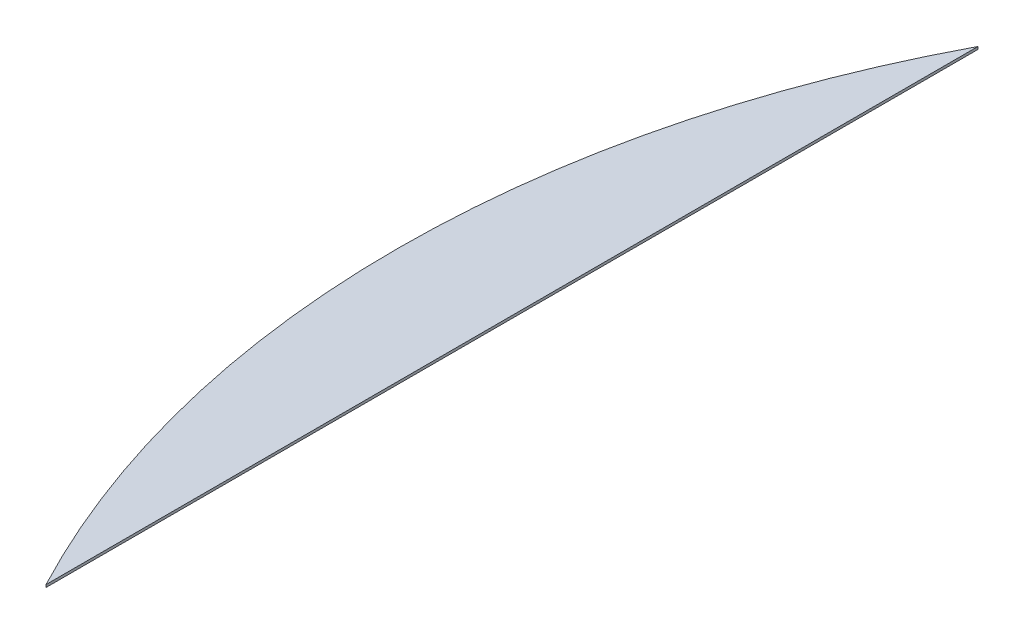
ISO-10303-21;
HEADER;
FILE_DESCRIPTION(('STEP AP214'),'2;1');
FILE_NAME('part.step','',(''),(''),'','','');
FILE_SCHEMA(('AUTOMOTIVE_DESIGN { 1 0 10303 214 1 1 1 1 }'));
ENDSEC;
DATA;
#1=APPLICATION_CONTEXT('core data for automotive mechanical design processes');
#2=APPLICATION_PROTOCOL_DEFINITION('international standard','automotive_design',2000,#1);
#3=PRODUCT_CONTEXT('',#1,'mechanical');
#4=PRODUCT('Part','Part','',(#3));
#5=PRODUCT_RELATED_PRODUCT_CATEGORY('part','',(#4));
#6=PRODUCT_DEFINITION_FORMATION('','',#4);
#7=PRODUCT_DEFINITION_CONTEXT('part definition',#1,'design');
#8=PRODUCT_DEFINITION('design','',#6,#7);
#9=PRODUCT_DEFINITION_SHAPE('','',#8);
#10=(LENGTH_UNIT() NAMED_UNIT(*) SI_UNIT(.MILLI.,.METRE.));
#11=(NAMED_UNIT(*) PLANE_ANGLE_UNIT() SI_UNIT($,.RADIAN.));
#12=(NAMED_UNIT(*) SI_UNIT($,.STERADIAN.) SOLID_ANGLE_UNIT());
#13=UNCERTAINTY_MEASURE_WITH_UNIT(LENGTH_MEASURE(1.E-05),#10,'distance_accuracy_value','');
#14=(GEOMETRIC_REPRESENTATION_CONTEXT(3) GLOBAL_UNCERTAINTY_ASSIGNED_CONTEXT((#13)) GLOBAL_UNIT_ASSIGNED_CONTEXT((#10,
#11,#12)) REPRESENTATION_CONTEXT('',''));
#15=CARTESIAN_POINT('',(0.,0.,0.));
#16=DIRECTION('',(0.,0.,1.));
#17=DIRECTION('',(1.,0.,0.));
#18=AXIS2_PLACEMENT_3D('',#15,#16,#17);
#19=CARTESIAN_POINT('',(0.,1043.,0.));
#20=DIRECTION('',(0.,-1.,0.));
#21=DIRECTION('',(0.,0.,-1.));
#22=AXIS2_PLACEMENT_3D('',#19,#20,#21);
#23=CYLINDRICAL_SURFACE('',#22,772.);
#24=CARTESIAN_POINT('',(0.,1041.,0.));
#25=DIRECTION('',(0.,1.,0.));
#26=DIRECTION('',(0.,0.,1.));
#27=AXIS2_PLACEMENT_3D('',#24,#25,#26);
#28=CIRCLE('',#27,772.);
#29=CARTESIAN_POINT('',(-683.,1041.,-359.854137116693));
#30=VERTEX_POINT('',#29);
#31=CARTESIAN_POINT('',(-683.,1041.,359.854137116693));
#32=VERTEX_POINT('',#31);
#33=EDGE_CURVE('E73',#30,#32,#28,.T.);
#34=ORIENTED_EDGE('',*,*,#33,.T.);
#35=DIRECTION('',(0.,-1.,0.));
#36=VECTOR('',#35,1.);
#37=CARTESIAN_POINT('',(-683.,1043.,359.854137116693));
#38=LINE('',#37,#36);
#39=CARTESIAN_POINT('',(-683.,1043.,359.854137116693));
#40=VERTEX_POINT('',#39);
#41=EDGE_CURVE('E11',#40,#32,#38,.T.);
#42=ORIENTED_EDGE('',*,*,#41,.F.);
#43=CARTESIAN_POINT('',(0.,1043.,0.));
#44=DIRECTION('',(0.,1.,0.));
#45=DIRECTION('',(0.,0.,1.));
#46=AXIS2_PLACEMENT_3D('',#43,#44,#45);
#47=CIRCLE('',#46,772.);
#48=CARTESIAN_POINT('',(-683.,1043.,-359.854137116693));
#49=VERTEX_POINT('',#48);
#50=EDGE_CURVE('E72',#49,#40,#47,.T.);
#51=ORIENTED_EDGE('',*,*,#50,.F.);
#52=DIRECTION('',(0.,-1.,0.));
#53=VECTOR('',#52,1.);
#54=CARTESIAN_POINT('',(-683.,1043.,-359.854137116693));
#55=LINE('',#54,#53);
#56=EDGE_CURVE('E49',#49,#30,#55,.T.);
#57=ORIENTED_EDGE('',*,*,#56,.T.);
#58=EDGE_LOOP('',(#34,#42,#51,#57));
#59=FACE_BOUND('',#58,.T.);
#60=ADVANCED_FACE('F40',(#59),#23,.T.);
#61=CARTESIAN_POINT('',(-683.,1043.,-359.854137116693));
#62=DIRECTION('',(-1.,0.,0.));
#63=DIRECTION('',(0.,0.,1.));
#64=AXIS2_PLACEMENT_3D('',#61,#62,#63);
#65=PLANE('',#64);
#66=DIRECTION('',(0.,0.,-1.));
#67=VECTOR('',#66,1.);
#68=CARTESIAN_POINT('',(-683.,1041.,-359.854137116693));
#69=LINE('',#68,#67);
#70=EDGE_CURVE('E64',#32,#30,#69,.T.);
#71=ORIENTED_EDGE('',*,*,#70,.T.);
#72=ORIENTED_EDGE('',*,*,#56,.F.);
#73=DIRECTION('',(0.,0.,-1.));
#74=VECTOR('',#73,1.);
#75=CARTESIAN_POINT('',(-683.,1043.,-359.854137116693));
#76=LINE('',#75,#74);
#77=EDGE_CURVE('E56',#40,#49,#76,.T.);
#78=ORIENTED_EDGE('',*,*,#77,.F.);
#79=ORIENTED_EDGE('',*,*,#41,.T.);
#80=EDGE_LOOP('',(#71,#72,#78,#79));
#81=FACE_BOUND('',#80,.T.);
#82=ADVANCED_FACE('F67',(#81),#65,.F.);
#83=CARTESIAN_POINT('',(0.,1043.,0.));
#84=DIRECTION('',(0.,1.,0.));
#85=DIRECTION('',(0.,0.,1.));
#86=AXIS2_PLACEMENT_3D('',#83,#84,#85);
#87=PLANE('',#86);
#88=ORIENTED_EDGE('',*,*,#50,.T.);
#89=ORIENTED_EDGE('',*,*,#77,.T.);
#90=EDGE_LOOP('',(#88,#89));
#91=FACE_BOUND('',#90,.T.);
#92=ADVANCED_FACE('F86',(#91),#87,.T.);
#93=CARTESIAN_POINT('',(0.,1041.,0.));
#94=DIRECTION('',(0.,1.,0.));
#95=DIRECTION('',(0.,0.,1.));
#96=AXIS2_PLACEMENT_3D('',#93,#94,#95);
#97=PLANE('',#96);
#98=ORIENTED_EDGE('',*,*,#33,.F.);
#99=ORIENTED_EDGE('',*,*,#70,.F.);
#100=EDGE_LOOP('',(#98,#99));
#101=FACE_BOUND('',#100,.T.);
#102=ADVANCED_FACE('F77',(#101),#97,.F.);
#103=CLOSED_SHELL('',(#60,#82,#92,#102));
#104=MANIFOLD_SOLID_BREP('B2',#103);
#105=ADVANCED_BREP_SHAPE_REPRESENTATION('',(#18,#104),#14);
#106=SHAPE_DEFINITION_REPRESENTATION(#9,#105);
ENDSEC;
END-ISO-10303-21;
